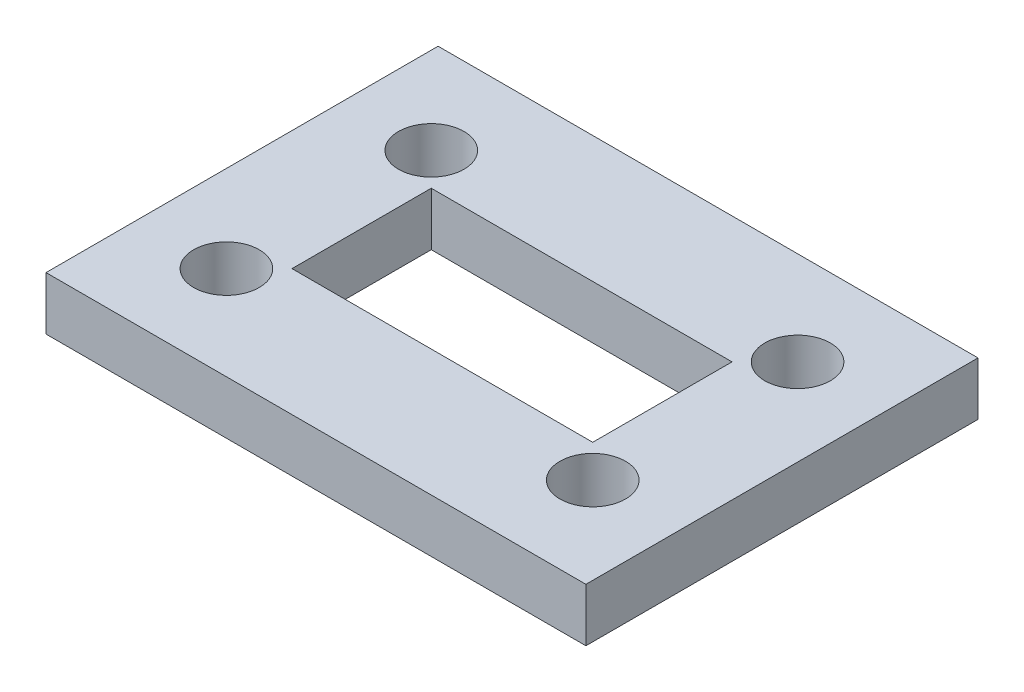
ISO-10303-21;
HEADER;
FILE_DESCRIPTION(('STEP AP214'),'2;1');
FILE_NAME('part.step','',(''),(''),'','','');
FILE_SCHEMA(('AUTOMOTIVE_DESIGN { 1 0 10303 214 1 1 1 1 }'));
ENDSEC;
DATA;
#1=APPLICATION_CONTEXT('core data for automotive mechanical design processes');
#2=APPLICATION_PROTOCOL_DEFINITION('international standard','automotive_design',2000,#1);
#3=PRODUCT_CONTEXT('',#1,'mechanical');
#4=PRODUCT('Part','Part','',(#3));
#5=PRODUCT_RELATED_PRODUCT_CATEGORY('part','',(#4));
#6=PRODUCT_DEFINITION_FORMATION('','',#4);
#7=PRODUCT_DEFINITION_CONTEXT('part definition',#1,'design');
#8=PRODUCT_DEFINITION('design','',#6,#7);
#9=PRODUCT_DEFINITION_SHAPE('','',#8);
#10=(LENGTH_UNIT() NAMED_UNIT(*) SI_UNIT(.MILLI.,.METRE.));
#11=(NAMED_UNIT(*) PLANE_ANGLE_UNIT() SI_UNIT($,.RADIAN.));
#12=(NAMED_UNIT(*) SI_UNIT($,.STERADIAN.) SOLID_ANGLE_UNIT());
#13=UNCERTAINTY_MEASURE_WITH_UNIT(LENGTH_MEASURE(1.E-05),#10,'distance_accuracy_value','');
#14=(GEOMETRIC_REPRESENTATION_CONTEXT(3) GLOBAL_UNCERTAINTY_ASSIGNED_CONTEXT((#13)) GLOBAL_UNIT_ASSIGNED_CONTEXT((#10,
#11,#12)) REPRESENTATION_CONTEXT('',''));
#15=CARTESIAN_POINT('',(0.,0.,0.));
#16=DIRECTION('',(0.,0.,1.));
#17=DIRECTION('',(1.,0.,0.));
#18=AXIS2_PLACEMENT_3D('',#15,#16,#17);
#19=CARTESIAN_POINT('',(0.,13.,-85.69));
#20=DIRECTION('',(0.,0.,-1.));
#21=DIRECTION('',(-1.,0.,0.));
#22=AXIS2_PLACEMENT_3D('',#19,#20,#21);
#23=PLANE('',#22);
#24=DIRECTION('',(1.,0.,0.));
#25=VECTOR('',#24,1.);
#26=CARTESIAN_POINT('',(0.,0.,-85.69));
#27=LINE('',#26,#25);
#28=CARTESIAN_POINT('',(-121.76,0.,-85.69));
#29=VERTEX_POINT('',#28);
#30=CARTESIAN_POINT('',(10.,0.,-85.69));
#31=VERTEX_POINT('',#30);
#32=EDGE_CURVE('E175',#29,#31,#27,.T.);
#33=ORIENTED_EDGE('',*,*,#32,.F.);
#34=DIRECTION('',(0.,-1.,0.));
#35=VECTOR('',#34,1.);
#36=CARTESIAN_POINT('',(-121.76,13.,-85.69));
#37=LINE('',#36,#35);
#38=CARTESIAN_POINT('',(-121.76,13.,-85.69));
#39=VERTEX_POINT('',#38);
#40=EDGE_CURVE('E11',#39,#29,#37,.T.);
#41=ORIENTED_EDGE('',*,*,#40,.F.);
#42=DIRECTION('',(1.,0.,0.));
#43=VECTOR('',#42,1.);
#44=CARTESIAN_POINT('',(0.,13.,-85.69));
#45=LINE('',#44,#43);
#46=CARTESIAN_POINT('',(10.,13.,-85.69));
#47=VERTEX_POINT('',#46);
#48=EDGE_CURVE('E133',#39,#47,#45,.T.);
#49=ORIENTED_EDGE('',*,*,#48,.T.);
#50=DIRECTION('',(0.,-1.,0.));
#51=VECTOR('',#50,1.);
#52=CARTESIAN_POINT('',(10.,13.,-85.69));
#53=LINE('',#52,#51);
#54=EDGE_CURVE('E59',#47,#31,#53,.T.);
#55=ORIENTED_EDGE('',*,*,#54,.T.);
#56=EDGE_LOOP('',(#33,#41,#49,#55));
#57=FACE_BOUND('',#56,.T.);
#58=ADVANCED_FACE('F39',(#57),#23,.T.);
#59=CARTESIAN_POINT('',(-121.76,13.,0.));
#60=DIRECTION('',(-1.,0.,0.));
#61=DIRECTION('',(0.,0.,1.));
#62=AXIS2_PLACEMENT_3D('',#59,#60,#61);
#63=PLANE('',#62);
#64=DIRECTION('',(0.,0.,-1.));
#65=VECTOR('',#64,1.);
#66=CARTESIAN_POINT('',(-121.76,0.,0.));
#67=LINE('',#66,#65);
#68=CARTESIAN_POINT('',(-121.76,0.,10.));
#69=VERTEX_POINT('',#68);
#70=EDGE_CURVE('E119',#69,#29,#67,.T.);
#71=ORIENTED_EDGE('',*,*,#70,.F.);
#72=DIRECTION('',(0.,-1.,0.));
#73=VECTOR('',#72,1.);
#74=CARTESIAN_POINT('',(-121.76,13.,10.));
#75=LINE('',#74,#73);
#76=CARTESIAN_POINT('',(-121.76,13.,10.));
#77=VERTEX_POINT('',#76);
#78=EDGE_CURVE('E50',#77,#69,#75,.T.);
#79=ORIENTED_EDGE('',*,*,#78,.F.);
#80=DIRECTION('',(0.,0.,-1.));
#81=VECTOR('',#80,1.);
#82=CARTESIAN_POINT('',(-121.76,13.,0.));
#83=LINE('',#82,#81);
#84=EDGE_CURVE('E117',#77,#39,#83,.T.);
#85=ORIENTED_EDGE('',*,*,#84,.T.);
#86=ORIENTED_EDGE('',*,*,#40,.T.);
#87=EDGE_LOOP('',(#71,#79,#85,#86));
#88=FACE_BOUND('',#87,.T.);
#89=ADVANCED_FACE('F115',(#88),#63,.T.);
#90=CARTESIAN_POINT('',(0.,13.,10.));
#91=DIRECTION('',(0.,0.,-1.));
#92=DIRECTION('',(-1.,0.,0.));
#93=AXIS2_PLACEMENT_3D('',#90,#91,#92);
#94=PLANE('',#93);
#95=DIRECTION('',(1.,0.,0.));
#96=VECTOR('',#95,1.);
#97=CARTESIAN_POINT('',(0.,0.,10.));
#98=LINE('',#97,#96);
#99=CARTESIAN_POINT('',(10.,0.,10.));
#100=VERTEX_POINT('',#99);
#101=EDGE_CURVE('E180',#69,#100,#98,.T.);
#102=ORIENTED_EDGE('',*,*,#101,.T.);
#103=DIRECTION('',(0.,-1.,0.));
#104=VECTOR('',#103,1.);
#105=CARTESIAN_POINT('',(10.,13.,10.));
#106=LINE('',#105,#104);
#107=CARTESIAN_POINT('',(10.,13.,10.));
#108=VERTEX_POINT('',#107);
#109=EDGE_CURVE('E85',#108,#100,#106,.T.);
#110=ORIENTED_EDGE('',*,*,#109,.F.);
#111=DIRECTION('',(1.,0.,0.));
#112=VECTOR('',#111,1.);
#113=CARTESIAN_POINT('',(0.,13.,10.));
#114=LINE('',#113,#112);
#115=EDGE_CURVE('E124',#77,#108,#114,.T.);
#116=ORIENTED_EDGE('',*,*,#115,.F.);
#117=ORIENTED_EDGE('',*,*,#78,.T.);
#118=EDGE_LOOP('',(#102,#110,#116,#117));
#119=FACE_BOUND('',#118,.T.);
#120=ADVANCED_FACE('F125',(#119),#94,.F.);
#121=CARTESIAN_POINT('',(-19.18,13.,0.));
#122=DIRECTION('',(1.,0.,0.));
#123=DIRECTION('',(0.,0.,-1.));
#124=AXIS2_PLACEMENT_3D('',#121,#122,#123);
#125=PLANE('',#124);
#126=DIRECTION('',(0.,0.,1.));
#127=VECTOR('',#126,1.);
#128=CARTESIAN_POINT('',(-19.18,0.,0.));
#129=LINE('',#128,#127);
#130=CARTESIAN_POINT('',(-19.18,0.,-54.84));
#131=VERTEX_POINT('',#130);
#132=CARTESIAN_POINT('',(-19.18,0.,-20.85));
#133=VERTEX_POINT('',#132);
#134=EDGE_CURVE('E144',#131,#133,#129,.T.);
#135=ORIENTED_EDGE('',*,*,#134,.T.);
#136=DIRECTION('',(0.,-1.,0.));
#137=VECTOR('',#136,1.);
#138=CARTESIAN_POINT('',(-19.18,13.,-20.85));
#139=LINE('',#138,#137);
#140=CARTESIAN_POINT('',(-19.18,13.,-20.85));
#141=VERTEX_POINT('',#140);
#142=EDGE_CURVE('E43',#141,#133,#139,.T.);
#143=ORIENTED_EDGE('',*,*,#142,.F.);
#144=DIRECTION('',(0.,0.,1.));
#145=VECTOR('',#144,1.);
#146=CARTESIAN_POINT('',(-19.18,13.,0.));
#147=LINE('',#146,#145);
#148=CARTESIAN_POINT('',(-19.18,13.,-54.84));
#149=VERTEX_POINT('',#148);
#150=EDGE_CURVE('E98',#149,#141,#147,.T.);
#151=ORIENTED_EDGE('',*,*,#150,.F.);
#152=DIRECTION('',(0.,-1.,0.));
#153=VECTOR('',#152,1.);
#154=CARTESIAN_POINT('',(-19.18,13.,-54.84));
#155=LINE('',#154,#153);
#156=EDGE_CURVE('E143',#149,#131,#155,.T.);
#157=ORIENTED_EDGE('',*,*,#156,.T.);
#158=EDGE_LOOP('',(#135,#143,#151,#157));
#159=FACE_BOUND('',#158,.T.);
#160=ADVANCED_FACE('F41',(#159),#125,.F.);
#161=CARTESIAN_POINT('',(0.,13.,-20.85));
#162=DIRECTION('',(0.,0.,-1.));
#163=DIRECTION('',(-1.,0.,0.));
#164=AXIS2_PLACEMENT_3D('',#161,#162,#163);
#165=PLANE('',#164);
#166=DIRECTION('',(1.,0.,0.));
#167=VECTOR('',#166,1.);
#168=CARTESIAN_POINT('',(0.,0.,-20.85));
#169=LINE('',#168,#167);
#170=CARTESIAN_POINT('',(-92.58,0.,-20.85));
#171=VERTEX_POINT('',#170);
#172=EDGE_CURVE('E148',#171,#133,#169,.T.);
#173=ORIENTED_EDGE('',*,*,#172,.F.);
#174=DIRECTION('',(0.,-1.,0.));
#175=VECTOR('',#174,1.);
#176=CARTESIAN_POINT('',(-92.58,13.,-20.85));
#177=LINE('',#176,#175);
#178=CARTESIAN_POINT('',(-92.58,13.,-20.85));
#179=VERTEX_POINT('',#178);
#180=EDGE_CURVE('E196',#179,#171,#177,.T.);
#181=ORIENTED_EDGE('',*,*,#180,.F.);
#182=DIRECTION('',(1.,0.,0.));
#183=VECTOR('',#182,1.);
#184=CARTESIAN_POINT('',(0.,13.,-20.85));
#185=LINE('',#184,#183);
#186=EDGE_CURVE('E206',#179,#141,#185,.T.);
#187=ORIENTED_EDGE('',*,*,#186,.T.);
#188=ORIENTED_EDGE('',*,*,#142,.T.);
#189=EDGE_LOOP('',(#173,#181,#187,#188));
#190=FACE_BOUND('',#189,.T.);
#191=ADVANCED_FACE('F205',(#190),#165,.T.);
#192=CARTESIAN_POINT('',(-92.58,13.,0.));
#193=DIRECTION('',(1.,0.,0.));
#194=DIRECTION('',(0.,0.,-1.));
#195=AXIS2_PLACEMENT_3D('',#192,#193,#194);
#196=PLANE('',#195);
#197=DIRECTION('',(0.,0.,1.));
#198=VECTOR('',#197,1.);
#199=CARTESIAN_POINT('',(-92.58,0.,0.));
#200=LINE('',#199,#198);
#201=CARTESIAN_POINT('',(-92.58,0.,-54.84));
#202=VERTEX_POINT('',#201);
#203=EDGE_CURVE('E152',#202,#171,#200,.T.);
#204=ORIENTED_EDGE('',*,*,#203,.F.);
#205=DIRECTION('',(0.,-1.,0.));
#206=VECTOR('',#205,1.);
#207=CARTESIAN_POINT('',(-92.58,13.,-54.84));
#208=LINE('',#207,#206);
#209=CARTESIAN_POINT('',(-92.58,13.,-54.84));
#210=VERTEX_POINT('',#209);
#211=EDGE_CURVE('E194',#210,#202,#208,.T.);
#212=ORIENTED_EDGE('',*,*,#211,.F.);
#213=DIRECTION('',(0.,0.,1.));
#214=VECTOR('',#213,1.);
#215=CARTESIAN_POINT('',(-92.58,13.,0.));
#216=LINE('',#215,#214);
#217=EDGE_CURVE('E217',#210,#179,#216,.T.);
#218=ORIENTED_EDGE('',*,*,#217,.T.);
#219=ORIENTED_EDGE('',*,*,#180,.T.);
#220=EDGE_LOOP('',(#204,#212,#218,#219));
#221=FACE_BOUND('',#220,.T.);
#222=ADVANCED_FACE('F214',(#221),#196,.T.);
#223=CARTESIAN_POINT('',(-11.1800000000001,13.,-62.84));
#224=DIRECTION('',(0.,-1.,0.));
#225=DIRECTION('',(0.,0.,-1.));
#226=AXIS2_PLACEMENT_3D('',#223,#224,#225);
#227=CYLINDRICAL_SURFACE('',#226,7.99999999999996);
#228=CARTESIAN_POINT('',(-11.1800000000001,13.,-62.84));
#229=DIRECTION('',(0.,1.,0.));
#230=DIRECTION('',(0.,0.,1.));
#231=AXIS2_PLACEMENT_3D('',#228,#229,#230);
#232=CIRCLE('',#231,7.99999999999996);
#233=CARTESIAN_POINT('',(-11.1800000000001,13.,-54.8400000000001));
#234=VERTEX_POINT('',#233);
#235=EDGE_CURVE('E137',#234,#234,#232,.T.);
#236=ORIENTED_EDGE('',*,*,#235,.T.);
#237=EDGE_LOOP('',(#236));
#238=FACE_BOUND('',#237,.T.);
#239=CARTESIAN_POINT('',(-11.1800000000001,0.,-62.84));
#240=DIRECTION('',(0.,1.,0.));
#241=DIRECTION('',(0.,0.,1.));
#242=AXIS2_PLACEMENT_3D('',#239,#240,#241);
#243=CIRCLE('',#242,7.99999999999996);
#244=CARTESIAN_POINT('',(-11.1800000000001,0.,-54.8400000000001));
#245=VERTEX_POINT('',#244);
#246=EDGE_CURVE('E171',#245,#245,#243,.T.);
#247=ORIENTED_EDGE('',*,*,#246,.F.);
#248=EDGE_LOOP('',(#247));
#249=FACE_BOUND('',#248,.T.);
#250=ADVANCED_FACE('F245',(#238,#249),#227,.F.);
#251=CARTESIAN_POINT('',(-100.58,13.,-62.84));
#252=DIRECTION('',(0.,-1.,0.));
#253=DIRECTION('',(0.,0.,-1.));
#254=AXIS2_PLACEMENT_3D('',#251,#252,#253);
#255=CYLINDRICAL_SURFACE('',#254,8.00000000000001);
#256=CARTESIAN_POINT('',(-100.58,13.,-62.84));
#257=DIRECTION('',(0.,1.,0.));
#258=DIRECTION('',(0.,0.,1.));
#259=AXIS2_PLACEMENT_3D('',#256,#257,#258);
#260=CIRCLE('',#259,8.00000000000001);
#261=CARTESIAN_POINT('',(-100.58,13.,-54.84));
#262=VERTEX_POINT('',#261);
#263=EDGE_CURVE('E238',#262,#262,#260,.T.);
#264=ORIENTED_EDGE('',*,*,#263,.T.);
#265=EDGE_LOOP('',(#264));
#266=FACE_BOUND('',#265,.T.);
#267=CARTESIAN_POINT('',(-100.58,0.,-62.84));
#268=DIRECTION('',(0.,1.,0.));
#269=DIRECTION('',(0.,0.,1.));
#270=AXIS2_PLACEMENT_3D('',#267,#268,#269);
#271=CIRCLE('',#270,8.00000000000001);
#272=CARTESIAN_POINT('',(-100.58,0.,-54.84));
#273=VERTEX_POINT('',#272);
#274=EDGE_CURVE('E167',#273,#273,#271,.T.);
#275=ORIENTED_EDGE('',*,*,#274,.F.);
#276=EDGE_LOOP('',(#275));
#277=FACE_BOUND('',#276,.T.);
#278=ADVANCED_FACE('F267',(#266,#277),#255,.F.);
#279=CARTESIAN_POINT('',(-100.58,13.,-12.85));
#280=DIRECTION('',(0.,-1.,0.));
#281=DIRECTION('',(0.,0.,-1.));
#282=AXIS2_PLACEMENT_3D('',#279,#280,#281);
#283=CYLINDRICAL_SURFACE('',#282,8.00000000000001);
#284=CARTESIAN_POINT('',(-100.58,13.,-12.85));
#285=DIRECTION('',(0.,1.,0.));
#286=DIRECTION('',(0.,0.,1.));
#287=AXIS2_PLACEMENT_3D('',#284,#285,#286);
#288=CIRCLE('',#287,8.00000000000001);
#289=CARTESIAN_POINT('',(-100.58,13.,-4.84999999999996));
#290=VERTEX_POINT('',#289);
#291=EDGE_CURVE('E234',#290,#290,#288,.T.);
#292=ORIENTED_EDGE('',*,*,#291,.T.);
#293=EDGE_LOOP('',(#292));
#294=FACE_BOUND('',#293,.T.);
#295=CARTESIAN_POINT('',(-100.58,0.,-12.85));
#296=DIRECTION('',(0.,1.,0.));
#297=DIRECTION('',(0.,0.,1.));
#298=AXIS2_PLACEMENT_3D('',#295,#296,#297);
#299=CIRCLE('',#298,8.00000000000001);
#300=CARTESIAN_POINT('',(-100.58,0.,-4.84999999999996));
#301=VERTEX_POINT('',#300);
#302=EDGE_CURVE('E163',#301,#301,#299,.T.);
#303=ORIENTED_EDGE('',*,*,#302,.F.);
#304=EDGE_LOOP('',(#303));
#305=FACE_BOUND('',#304,.T.);
#306=ADVANCED_FACE('F270',(#294,#305),#283,.F.);
#307=CARTESIAN_POINT('',(-11.18,13.,-12.85));
#308=DIRECTION('',(0.,-1.,0.));
#309=DIRECTION('',(0.,0.,-1.));
#310=AXIS2_PLACEMENT_3D('',#307,#308,#309);
#311=CYLINDRICAL_SURFACE('',#310,8.00000000000002);
#312=CARTESIAN_POINT('',(-11.18,13.,-12.85));
#313=DIRECTION('',(0.,1.,0.));
#314=DIRECTION('',(0.,0.,1.));
#315=AXIS2_PLACEMENT_3D('',#312,#313,#314);
#316=CIRCLE('',#315,8.00000000000002);
#317=CARTESIAN_POINT('',(-11.18,13.,-4.84999999999996));
#318=VERTEX_POINT('',#317);
#319=EDGE_CURVE('E222',#318,#318,#316,.T.);
#320=ORIENTED_EDGE('',*,*,#319,.T.);
#321=EDGE_LOOP('',(#320));
#322=FACE_BOUND('',#321,.T.);
#323=CARTESIAN_POINT('',(-11.18,0.,-12.85));
#324=DIRECTION('',(0.,1.,0.));
#325=DIRECTION('',(0.,0.,1.));
#326=AXIS2_PLACEMENT_3D('',#323,#324,#325);
#327=CIRCLE('',#326,8.00000000000002);
#328=CARTESIAN_POINT('',(-11.18,0.,-4.84999999999996));
#329=VERTEX_POINT('',#328);
#330=EDGE_CURVE('E159',#329,#329,#327,.T.);
#331=ORIENTED_EDGE('',*,*,#330,.F.);
#332=EDGE_LOOP('',(#331));
#333=FACE_BOUND('',#332,.T.);
#334=ADVANCED_FACE('F274',(#322,#333),#311,.F.);
#335=CARTESIAN_POINT('',(0.,13.,-54.84));
#336=DIRECTION('',(0.,0.,-1.));
#337=DIRECTION('',(-1.,0.,0.));
#338=AXIS2_PLACEMENT_3D('',#335,#336,#337);
#339=PLANE('',#338);
#340=DIRECTION('',(1.,0.,0.));
#341=VECTOR('',#340,1.);
#342=CARTESIAN_POINT('',(0.,0.,-54.84));
#343=LINE('',#342,#341);
#344=EDGE_CURVE('E156',#202,#131,#343,.T.);
#345=ORIENTED_EDGE('',*,*,#344,.T.);
#346=ORIENTED_EDGE('',*,*,#156,.F.);
#347=DIRECTION('',(1.,0.,0.));
#348=VECTOR('',#347,1.);
#349=CARTESIAN_POINT('',(0.,13.,-54.84));
#350=LINE('',#349,#348);
#351=EDGE_CURVE('E219',#210,#149,#350,.T.);
#352=ORIENTED_EDGE('',*,*,#351,.F.);
#353=ORIENTED_EDGE('',*,*,#211,.T.);
#354=EDGE_LOOP('',(#345,#346,#352,#353));
#355=FACE_BOUND('',#354,.T.);
#356=ADVANCED_FACE('F220',(#355),#339,.F.);
#357=CARTESIAN_POINT('',(10.,13.,0.));
#358=DIRECTION('',(1.,0.,0.));
#359=DIRECTION('',(0.,0.,-1.));
#360=AXIS2_PLACEMENT_3D('',#357,#358,#359);
#361=PLANE('',#360);
#362=DIRECTION('',(0.,0.,1.));
#363=VECTOR('',#362,1.);
#364=CARTESIAN_POINT('',(10.,0.,0.));
#365=LINE('',#364,#363);
#366=EDGE_CURVE('E183',#31,#100,#365,.T.);
#367=ORIENTED_EDGE('',*,*,#366,.F.);
#368=ORIENTED_EDGE('',*,*,#54,.F.);
#369=DIRECTION('',(0.,0.,1.));
#370=VECTOR('',#369,1.);
#371=CARTESIAN_POINT('',(10.,13.,0.));
#372=LINE('',#371,#370);
#373=EDGE_CURVE('E129',#47,#108,#372,.T.);
#374=ORIENTED_EDGE('',*,*,#373,.T.);
#375=ORIENTED_EDGE('',*,*,#109,.T.);
#376=EDGE_LOOP('',(#367,#368,#374,#375));
#377=FACE_BOUND('',#376,.T.);
#378=ADVANCED_FACE('F249',(#377),#361,.T.);
#379=CARTESIAN_POINT('',(0.,13.,0.));
#380=DIRECTION('',(0.,1.,0.));
#381=DIRECTION('',(0.,0.,1.));
#382=AXIS2_PLACEMENT_3D('',#379,#380,#381);
#383=PLANE('',#382);
#384=ORIENTED_EDGE('',*,*,#150,.T.);
#385=ORIENTED_EDGE('',*,*,#186,.F.);
#386=ORIENTED_EDGE('',*,*,#217,.F.);
#387=ORIENTED_EDGE('',*,*,#351,.T.);
#388=EDGE_LOOP('',(#384,#385,#386,#387));
#389=FACE_BOUND('',#388,.T.);
#390=ORIENTED_EDGE('',*,*,#319,.F.);
#391=EDGE_LOOP('',(#390));
#392=FACE_BOUND('',#391,.T.);
#393=ORIENTED_EDGE('',*,*,#291,.F.);
#394=EDGE_LOOP('',(#393));
#395=FACE_BOUND('',#394,.T.);
#396=ORIENTED_EDGE('',*,*,#263,.F.);
#397=EDGE_LOOP('',(#396));
#398=FACE_BOUND('',#397,.T.);
#399=ORIENTED_EDGE('',*,*,#235,.F.);
#400=EDGE_LOOP('',(#399));
#401=FACE_BOUND('',#400,.T.);
#402=ORIENTED_EDGE('',*,*,#48,.F.);
#403=ORIENTED_EDGE('',*,*,#84,.F.);
#404=ORIENTED_EDGE('',*,*,#115,.T.);
#405=ORIENTED_EDGE('',*,*,#373,.F.);
#406=EDGE_LOOP('',(#402,#403,#404,#405));
#407=FACE_BOUND('',#406,.T.);
#408=ADVANCED_FACE('F132',(#389,#392,#395,#398,#401,#407),#383,.T.);
#409=CARTESIAN_POINT('',(0.,0.,0.));
#410=DIRECTION('',(0.,1.,0.));
#411=DIRECTION('',(0.,0.,1.));
#412=AXIS2_PLACEMENT_3D('',#409,#410,#411);
#413=PLANE('',#412);
#414=ORIENTED_EDGE('',*,*,#134,.F.);
#415=ORIENTED_EDGE('',*,*,#344,.F.);
#416=ORIENTED_EDGE('',*,*,#203,.T.);
#417=ORIENTED_EDGE('',*,*,#172,.T.);
#418=EDGE_LOOP('',(#414,#415,#416,#417));
#419=FACE_BOUND('',#418,.T.);
#420=ORIENTED_EDGE('',*,*,#330,.T.);
#421=EDGE_LOOP('',(#420));
#422=FACE_BOUND('',#421,.T.);
#423=ORIENTED_EDGE('',*,*,#302,.T.);
#424=EDGE_LOOP('',(#423));
#425=FACE_BOUND('',#424,.T.);
#426=ORIENTED_EDGE('',*,*,#274,.T.);
#427=EDGE_LOOP('',(#426));
#428=FACE_BOUND('',#427,.T.);
#429=ORIENTED_EDGE('',*,*,#246,.T.);
#430=EDGE_LOOP('',(#429));
#431=FACE_BOUND('',#430,.T.);
#432=ORIENTED_EDGE('',*,*,#32,.T.);
#433=ORIENTED_EDGE('',*,*,#366,.T.);
#434=ORIENTED_EDGE('',*,*,#101,.F.);
#435=ORIENTED_EDGE('',*,*,#70,.T.);
#436=EDGE_LOOP('',(#432,#433,#434,#435));
#437=FACE_BOUND('',#436,.T.);
#438=ADVANCED_FACE('F212',(#419,#422,#425,#428,#431,#437),#413,.F.);
#439=CLOSED_SHELL('',(#58,#89,#120,#160,#191,#222,#250,#278,#306,#334,#356,#378,#408,#438));
#440=MANIFOLD_SOLID_BREP('B2',#439);
#441=ADVANCED_BREP_SHAPE_REPRESENTATION('',(#18,#440),#14);
#442=SHAPE_DEFINITION_REPRESENTATION(#9,#441);
ENDSEC;
END-ISO-10303-21;
